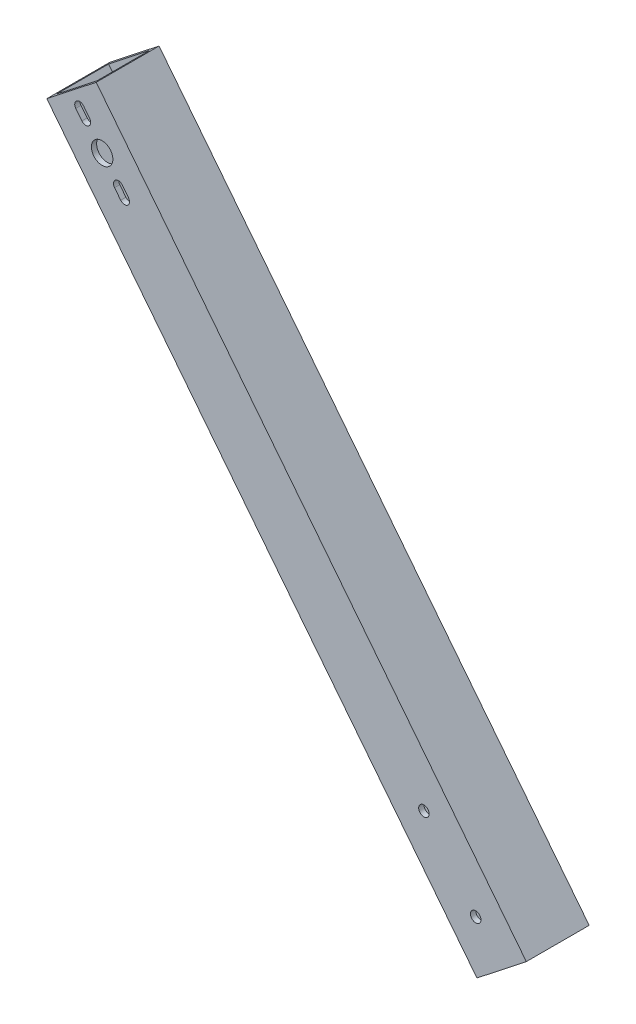
ISO-10303-21;
HEADER;
FILE_DESCRIPTION(('STEP AP214'),'2;1');
FILE_NAME('part.step','',(''),(''),'','','');
FILE_SCHEMA(('AUTOMOTIVE_DESIGN { 1 0 10303 214 1 1 1 1 }'));
ENDSEC;
DATA;
#1=APPLICATION_CONTEXT('core data for automotive mechanical design processes');
#2=APPLICATION_PROTOCOL_DEFINITION('international standard','automotive_design',2000,#1);
#3=PRODUCT_CONTEXT('',#1,'mechanical');
#4=PRODUCT('Part','Part','',(#3));
#5=PRODUCT_RELATED_PRODUCT_CATEGORY('part','',(#4));
#6=PRODUCT_DEFINITION_FORMATION('','',#4);
#7=PRODUCT_DEFINITION_CONTEXT('part definition',#1,'design');
#8=PRODUCT_DEFINITION('design','',#6,#7);
#9=PRODUCT_DEFINITION_SHAPE('','',#8);
#10=(LENGTH_UNIT() NAMED_UNIT(*) SI_UNIT(.MILLI.,.METRE.));
#11=(NAMED_UNIT(*) PLANE_ANGLE_UNIT() SI_UNIT($,.RADIAN.));
#12=(NAMED_UNIT(*) SI_UNIT($,.STERADIAN.) SOLID_ANGLE_UNIT());
#13=UNCERTAINTY_MEASURE_WITH_UNIT(LENGTH_MEASURE(1.E-05),#10,'distance_accuracy_value','');
#14=(GEOMETRIC_REPRESENTATION_CONTEXT(3) GLOBAL_UNCERTAINTY_ASSIGNED_CONTEXT((#13)) GLOBAL_UNIT_ASSIGNED_CONTEXT((#10,
#11,#12)) REPRESENTATION_CONTEXT('',''));
#15=CARTESIAN_POINT('',(0.,0.,0.));
#16=DIRECTION('',(0.,0.,1.));
#17=DIRECTION('',(1.,0.,0.));
#18=AXIS2_PLACEMENT_3D('',#15,#16,#17);
#19=CARTESIAN_POINT('',(-90.1801665532272,35.,19.05));
#20=DIRECTION('',(-0.618490386596824,0.78579236550587,0.));
#21=DIRECTION('',(-0.78579236550587,-0.618490386596824,0.));
#22=AXIS2_PLACEMENT_3D('',#19,#20,#21);
#23=PLANE('',#22);
#24=DIRECTION('',(0.78579236550587,0.618490386596824,0.));
#25=VECTOR('',#24,1.);
#26=CARTESIAN_POINT('',(-90.1801665532272,35.,0.));
#27=LINE('',#26,#25);
#28=CARTESIAN_POINT('',(-90.1801665532272,35.,0.));
#29=VERTEX_POINT('',#28);
#30=CARTESIAN_POINT('',(-75.2108219903403,46.7822418646695,0.));
#31=VERTEX_POINT('',#30);
#32=EDGE_CURVE('E365',#29,#31,#27,.T.);
#33=ORIENTED_EDGE('',*,*,#32,.T.);
#34=DIRECTION('',(0.,0.,-1.));
#35=VECTOR('',#34,1.);
#36=CARTESIAN_POINT('',(-75.2108219903403,46.7822418646695,19.05));
#37=LINE('',#36,#35);
#38=CARTESIAN_POINT('',(-75.2108219903403,46.7822418646695,19.05));
#39=VERTEX_POINT('',#38);
#40=EDGE_CURVE('E375',#39,#31,#37,.T.);
#41=ORIENTED_EDGE('',*,*,#40,.F.);
#42=DIRECTION('',(0.78579236550587,0.618490386596824,0.));
#43=VECTOR('',#42,1.);
#44=CARTESIAN_POINT('',(-90.1801665532272,35.,19.05));
#45=LINE('',#44,#43);
#46=CARTESIAN_POINT('',(-90.1801665532272,35.,19.05));
#47=VERTEX_POINT('',#46);
#48=EDGE_CURVE('E355',#47,#39,#45,.T.);
#49=ORIENTED_EDGE('',*,*,#48,.F.);
#50=DIRECTION('',(0.,0.,-1.));
#51=VECTOR('',#50,1.);
#52=CARTESIAN_POINT('',(-90.1801665532272,35.,19.05));
#53=LINE('',#52,#51);
#54=EDGE_CURVE('E372',#47,#29,#53,.T.);
#55=ORIENTED_EDGE('',*,*,#54,.T.);
#56=EDGE_LOOP('',(#33,#41,#49,#55));
#57=FACE_BOUND('',#56,.T.);
#58=DIRECTION('',(0.78579236550587,0.618490386596824,0.));
#59=VECTOR('',#58,1.);
#60=CARTESIAN_POINT('',(-51.5068272617335,65.4394514624581,1.5875));
#61=LINE('',#60,#59);
#62=CARTESIAN_POINT('',(-88.9327211729866,35.9818534887225,1.5875));
#63=VERTEX_POINT('',#62);
#64=CARTESIAN_POINT('',(-76.4582673705809,45.800388375947,1.5875));
#65=VERTEX_POINT('',#64);
#66=EDGE_CURVE('E329',#63,#65,#61,.T.);
#67=ORIENTED_EDGE('',*,*,#66,.F.);
#68=DIRECTION('',(0.,0.,-1.));
#69=VECTOR('',#68,1.);
#70=CARTESIAN_POINT('',(-88.9327211729866,35.9818534887225,19.05));
#71=LINE('',#70,#69);
#72=CARTESIAN_POINT('',(-88.9327211729866,35.9818534887225,17.4625));
#73=VERTEX_POINT('',#72);
#74=EDGE_CURVE('E339',#73,#63,#71,.T.);
#75=ORIENTED_EDGE('',*,*,#74,.F.);
#76=DIRECTION('',(0.78579236550587,0.618490386596824,0.));
#77=VECTOR('',#76,1.);
#78=CARTESIAN_POINT('',(-51.5068272617335,65.4394514624581,17.4625));
#79=LINE('',#78,#77);
#80=CARTESIAN_POINT('',(-76.4582673705809,45.800388375947,17.4625));
#81=VERTEX_POINT('',#80);
#82=EDGE_CURVE('E334',#73,#81,#79,.T.);
#83=ORIENTED_EDGE('',*,*,#82,.T.);
#84=DIRECTION('',(0.,0.,-1.));
#85=VECTOR('',#84,1.);
#86=CARTESIAN_POINT('',(-76.4582673705809,45.8003883759471,19.05));
#87=LINE('',#86,#85);
#88=EDGE_CURVE('E333',#81,#65,#87,.T.);
#89=ORIENTED_EDGE('',*,*,#88,.T.);
#90=EDGE_LOOP('',(#67,#75,#83,#89));
#91=FACE_BOUND('',#90,.T.);
#92=ADVANCED_FACE('F33',(#57,#91),#23,.F.);
#93=CARTESIAN_POINT('',(-220.57030985557,200.660746495948,19.05));
#94=DIRECTION('',(-0.618490386596824,0.78579236550587,0.));
#95=DIRECTION('',(-0.78579236550587,-0.618490386596824,0.));
#96=AXIS2_PLACEMENT_3D('',#93,#94,#95);
#97=PLANE('',#96);
#98=DIRECTION('',(0.,0.,-1.));
#99=VECTOR('',#98,1.);
#100=CARTESIAN_POINT('',(-206.848410672923,211.461134871895,1.5875));
#101=LINE('',#100,#99);
#102=CARTESIAN_POINT('',(-206.848410672923,211.461134871895,17.4625));
#103=VERTEX_POINT('',#102);
#104=CARTESIAN_POINT('',(-206.848410672923,211.461134871895,1.5875));
#105=VERTEX_POINT('',#104);
#106=EDGE_CURVE('E313',#103,#105,#101,.T.);
#107=ORIENTED_EDGE('',*,*,#106,.F.);
#108=DIRECTION('',(0.785792365505869,0.618490386596826,0.));
#109=VECTOR('',#108,1.);
#110=CARTESIAN_POINT('',(-219.322864475329,201.64259998467,17.4625));
#111=LINE('',#110,#109);
#112=CARTESIAN_POINT('',(-219.322864475329,201.64259998467,17.4625));
#113=VERTEX_POINT('',#112);
#114=EDGE_CURVE('E322',#113,#103,#111,.T.);
#115=ORIENTED_EDGE('',*,*,#114,.F.);
#116=DIRECTION('',(0.,0.,1.));
#117=VECTOR('',#116,1.);
#118=CARTESIAN_POINT('',(-219.322864475329,201.64259998467,1.5875));
#119=LINE('',#118,#117);
#120=CARTESIAN_POINT('',(-219.322864475329,201.64259998467,1.5875));
#121=VERTEX_POINT('',#120);
#122=EDGE_CURVE('E319',#121,#113,#119,.T.);
#123=ORIENTED_EDGE('',*,*,#122,.F.);
#124=DIRECTION('',(-0.78579236550587,-0.618490386596824,0.));
#125=VECTOR('',#124,1.);
#126=CARTESIAN_POINT('',(-219.322864475329,201.64259998467,1.5875));
#127=LINE('',#126,#125);
#128=EDGE_CURVE('E316',#105,#121,#127,.T.);
#129=ORIENTED_EDGE('',*,*,#128,.F.);
#130=EDGE_LOOP('',(#107,#115,#123,#129));
#131=FACE_BOUND('',#130,.T.);
#132=DIRECTION('',(0.78579236550587,0.618490386596824,0.));
#133=VECTOR('',#132,1.);
#134=CARTESIAN_POINT('',(-220.57030985557,200.660746495948,0.));
#135=LINE('',#134,#133);
#136=CARTESIAN_POINT('',(-220.57030985557,200.660746495948,0.));
#137=VERTEX_POINT('',#136);
#138=CARTESIAN_POINT('',(-205.600965292683,212.442988360617,0.));
#139=VERTEX_POINT('',#138);
#140=EDGE_CURVE('E342',#137,#139,#135,.T.);
#141=ORIENTED_EDGE('',*,*,#140,.F.);
#142=DIRECTION('',(0.,0.,-1.));
#143=VECTOR('',#142,1.);
#144=CARTESIAN_POINT('',(-220.57030985557,200.660746495948,19.05));
#145=LINE('',#144,#143);
#146=CARTESIAN_POINT('',(-220.57030985557,200.660746495948,19.05));
#147=VERTEX_POINT('',#146);
#148=EDGE_CURVE('E369',#147,#137,#145,.T.);
#149=ORIENTED_EDGE('',*,*,#148,.F.);
#150=DIRECTION('',(0.78579236550587,0.618490386596824,0.));
#151=VECTOR('',#150,1.);
#152=CARTESIAN_POINT('',(-220.57030985557,200.660746495948,19.05));
#153=LINE('',#152,#151);
#154=CARTESIAN_POINT('',(-205.600965292683,212.442988360617,19.05));
#155=VERTEX_POINT('',#154);
#156=EDGE_CURVE('E348',#147,#155,#153,.T.);
#157=ORIENTED_EDGE('',*,*,#156,.T.);
#158=DIRECTION('',(0.,0.,-1.));
#159=VECTOR('',#158,1.);
#160=CARTESIAN_POINT('',(-205.600965292683,212.442988360617,19.05));
#161=LINE('',#160,#159);
#162=EDGE_CURVE('E359',#155,#139,#161,.T.);
#163=ORIENTED_EDGE('',*,*,#162,.T.);
#164=EDGE_LOOP('',(#141,#149,#157,#163));
#165=FACE_BOUND('',#164,.T.);
#166=ADVANCED_FACE('F35',(#131,#165),#97,.T.);
#167=CARTESIAN_POINT('',(-220.57030985557,200.660746495948,19.05));
#168=DIRECTION('',(0.78579236550587,0.618490386596824,0.));
#169=DIRECTION('',(-0.618490386596824,0.78579236550587,0.));
#170=AXIS2_PLACEMENT_3D('',#167,#168,#169);
#171=PLANE('',#170);
#172=DIRECTION('',(0.618490386596824,-0.78579236550587,0.));
#173=VECTOR('',#172,1.);
#174=CARTESIAN_POINT('',(-220.57030985557,200.660746495948,0.));
#175=LINE('',#174,#173);
#176=EDGE_CURVE('E352',#137,#29,#175,.T.);
#177=ORIENTED_EDGE('',*,*,#176,.T.);
#178=ORIENTED_EDGE('',*,*,#54,.F.);
#179=DIRECTION('',(0.618490386596824,-0.78579236550587,0.));
#180=VECTOR('',#179,1.);
#181=CARTESIAN_POINT('',(-220.57030985557,200.660746495948,19.05));
#182=LINE('',#181,#180);
#183=EDGE_CURVE('E357',#147,#47,#182,.T.);
#184=ORIENTED_EDGE('',*,*,#183,.F.);
#185=ORIENTED_EDGE('',*,*,#148,.T.);
#186=EDGE_LOOP('',(#177,#178,#184,#185));
#187=FACE_BOUND('',#186,.T.);
#188=ADVANCED_FACE('F430',(#187),#171,.F.);
#189=CARTESIAN_POINT('',(-205.600965292683,212.442988360617,19.05));
#190=DIRECTION('',(0.78579236550587,0.618490386596824,0.));
#191=DIRECTION('',(-0.618490386596824,0.78579236550587,0.));
#192=AXIS2_PLACEMENT_3D('',#189,#190,#191);
#193=PLANE('',#192);
#194=DIRECTION('',(0.618490386596824,-0.78579236550587,0.));
#195=VECTOR('',#194,1.);
#196=CARTESIAN_POINT('',(-205.600965292683,212.442988360617,0.));
#197=LINE('',#196,#195);
#198=EDGE_CURVE('E362',#139,#31,#197,.T.);
#199=ORIENTED_EDGE('',*,*,#198,.F.);
#200=ORIENTED_EDGE('',*,*,#162,.F.);
#201=DIRECTION('',(0.618490386596824,-0.78579236550587,0.));
#202=VECTOR('',#201,1.);
#203=CARTESIAN_POINT('',(-205.600965292683,212.442988360617,19.05));
#204=LINE('',#203,#202);
#205=EDGE_CURVE('E351',#155,#39,#204,.T.);
#206=ORIENTED_EDGE('',*,*,#205,.T.);
#207=ORIENTED_EDGE('',*,*,#40,.T.);
#208=EDGE_LOOP('',(#199,#200,#206,#207));
#209=FACE_BOUND('',#208,.T.);
#210=ADVANCED_FACE('F435',(#209),#193,.T.);
#211=CARTESIAN_POINT('',(0.,0.,19.05));
#212=DIRECTION('',(0.,0.,-1.));
#213=DIRECTION('',(-1.,0.,0.));
#214=AXIS2_PLACEMENT_3D('',#211,#212,#213);
#215=PLANE('',#214);
#216=CARTESIAN_POINT('',(-208.755814971609,201.050825506234,19.05));
#217=DIRECTION('',(0.,0.,1.));
#218=DIRECTION('',(1.,0.,0.));
#219=AXIS2_PLACEMENT_3D('',#216,#217,#218);
#220=CIRCLE('',#219,1.50000000000003);
#221=CARTESIAN_POINT('',(-209.934503519868,200.123089926339,19.05));
#222=VERTEX_POINT('',#221);
#223=CARTESIAN_POINT('',(-207.57712642335,201.978561086129,19.05));
#224=VERTEX_POINT('',#223);
#225=EDGE_CURVE('E218',#222,#224,#220,.T.);
#226=ORIENTED_EDGE('',*,*,#225,.F.);
#227=DIRECTION('',(0.618490386596824,-0.785792365505871,0.));
#228=VECTOR('',#227,1.);
#229=CARTESIAN_POINT('',(-211.789974679658,202.480467022856,19.05));
#230=LINE('',#229,#228);
#231=CARTESIAN_POINT('',(-211.789974679658,202.480467022856,19.05));
#232=VERTEX_POINT('',#231);
#233=EDGE_CURVE('E527',#232,#222,#230,.T.);
#234=ORIENTED_EDGE('',*,*,#233,.F.);
#235=CARTESIAN_POINT('',(-210.611286131399,203.408202602752,19.05));
#236=DIRECTION('',(0.,0.,1.));
#237=DIRECTION('',(1.,0.,0.));
#238=AXIS2_PLACEMENT_3D('',#235,#236,#237);
#239=CIRCLE('',#238,1.50000000000003);
#240=CARTESIAN_POINT('',(-209.43259758314,204.335938182647,19.05));
#241=VERTEX_POINT('',#240);
#242=EDGE_CURVE('E222',#241,#232,#239,.T.);
#243=ORIENTED_EDGE('',*,*,#242,.F.);
#244=DIRECTION('',(-0.618490386596824,0.785792365505871,0.));
#245=VECTOR('',#244,1.);
#246=CARTESIAN_POINT('',(-209.43259758314,204.335938182647,19.05));
#247=LINE('',#246,#245);
#248=EDGE_CURVE('E48',#224,#241,#247,.T.);
#249=ORIENTED_EDGE('',*,*,#248,.F.);
#250=EDGE_LOOP('',(#226,#234,#243,#249));
#251=FACE_BOUND('',#250,.T.);
#252=CARTESIAN_POINT('',(-197.004497626269,186.120770561622,19.05));
#253=DIRECTION('',(0.,0.,1.));
#254=DIRECTION('',(1.,0.,0.));
#255=AXIS2_PLACEMENT_3D('',#252,#253,#254);
#256=CIRCLE('',#255,1.49999999999999);
#257=CARTESIAN_POINT('',(-198.183186174528,185.193034981727,19.05));
#258=VERTEX_POINT('',#257);
#259=CARTESIAN_POINT('',(-195.82580907801,187.048506141518,19.05));
#260=VERTEX_POINT('',#259);
#261=EDGE_CURVE('E246',#258,#260,#256,.T.);
#262=ORIENTED_EDGE('',*,*,#261,.F.);
#263=DIRECTION('',(0.61849038659682,-0.785792365505873,0.));
#264=VECTOR('',#263,1.);
#265=CARTESIAN_POINT('',(-200.038657334318,187.550412078245,19.05));
#266=LINE('',#265,#264);
#267=CARTESIAN_POINT('',(-200.038657334318,187.550412078245,19.05));
#268=VERTEX_POINT('',#267);
#269=EDGE_CURVE('E249',#268,#258,#266,.T.);
#270=ORIENTED_EDGE('',*,*,#269,.F.);
#271=CARTESIAN_POINT('',(-198.85996878606,188.47814765814,19.05));
#272=DIRECTION('',(0.,0.,1.));
#273=DIRECTION('',(1.,0.,0.));
#274=AXIS2_PLACEMENT_3D('',#271,#272,#273);
#275=CIRCLE('',#274,1.49999999999999);
#276=CARTESIAN_POINT('',(-197.681280237801,189.405883238035,19.05));
#277=VERTEX_POINT('',#276);
#278=EDGE_CURVE('E242',#277,#268,#275,.T.);
#279=ORIENTED_EDGE('',*,*,#278,.F.);
#280=DIRECTION('',(-0.61849038659682,0.785792365505873,0.));
#281=VECTOR('',#280,1.);
#282=CARTESIAN_POINT('',(-197.681280237801,189.405883238035,19.05));
#283=LINE('',#282,#281);
#284=EDGE_CURVE('E243',#260,#277,#283,.T.);
#285=ORIENTED_EDGE('',*,*,#284,.F.);
#286=EDGE_LOOP('',(#262,#270,#279,#285));
#287=FACE_BOUND('',#286,.T.);
#288=CARTESIAN_POINT('',(-90.5503221815634,50.8706839742593,19.05));
#289=DIRECTION('',(0.,0.,1.));
#290=DIRECTION('',(1.,0.,0.));
#291=AXIS2_PLACEMENT_3D('',#288,#289,#290);
#292=CIRCLE('',#291,1.5875);
#293=CARTESIAN_POINT('',(-88.9628221815634,50.8706839742593,19.05));
#294=VERTEX_POINT('',#293);
#295=EDGE_CURVE('E289',#294,#294,#292,.T.);
#296=ORIENTED_EDGE('',*,*,#295,.F.);
#297=EDGE_LOOP('',(#296));
#298=FACE_BOUND('',#297,.T.);
#299=CARTESIAN_POINT('',(-106.259978001123,70.8298100581084,19.05));
#300=DIRECTION('',(0.,0.,1.));
#301=DIRECTION('',(1.,0.,0.));
#302=AXIS2_PLACEMENT_3D('',#299,#300,#301);
#303=CIRCLE('',#302,1.5875);
#304=CARTESIAN_POINT('',(-104.672478001123,70.8298100581084,19.05));
#305=VERTEX_POINT('',#304);
#306=EDGE_CURVE('E299',#305,#305,#303,.T.);
#307=ORIENTED_EDGE('',*,*,#306,.F.);
#308=EDGE_LOOP('',(#307));
#309=FACE_BOUND('',#308,.T.);
#310=CARTESIAN_POINT('',(-203.807891878834,194.764486582187,19.05));
#311=DIRECTION('',(0.,0.,1.));
#312=DIRECTION('',(1.,0.,0.));
#313=AXIS2_PLACEMENT_3D('',#310,#311,#312);
#314=CIRCLE('',#313,3.25000000000001);
#315=CARTESIAN_POINT('',(-200.557891878834,194.764486582187,19.05));
#316=VERTEX_POINT('',#315);
#317=EDGE_CURVE('E309',#316,#316,#314,.T.);
#318=ORIENTED_EDGE('',*,*,#317,.F.);
#319=EDGE_LOOP('',(#318));
#320=FACE_BOUND('',#319,.T.);
#321=ORIENTED_EDGE('',*,*,#156,.F.);
#322=ORIENTED_EDGE('',*,*,#183,.T.);
#323=ORIENTED_EDGE('',*,*,#48,.T.);
#324=ORIENTED_EDGE('',*,*,#205,.F.);
#325=EDGE_LOOP('',(#321,#322,#323,#324));
#326=FACE_BOUND('',#325,.T.);
#327=ADVANCED_FACE('F437',(#251,#287,#298,#309,#320,#326),#215,.F.);
#328=CARTESIAN_POINT('',(0.,0.,0.));
#329=DIRECTION('',(0.,0.,-1.));
#330=DIRECTION('',(-1.,0.,0.));
#331=AXIS2_PLACEMENT_3D('',#328,#329,#330);
#332=PLANE('',#331);
#333=DIRECTION('',(0.618490386596824,-0.785792365505871,0.));
#334=VECTOR('',#333,1.);
#335=CARTESIAN_POINT('',(-211.789974679658,202.480467022856,0.));
#336=LINE('',#335,#334);
#337=CARTESIAN_POINT('',(-211.789974679658,202.480467022856,0.));
#338=VERTEX_POINT('',#337);
#339=CARTESIAN_POINT('',(-209.934503519868,200.123089926339,0.));
#340=VERTEX_POINT('',#339);
#341=EDGE_CURVE('E210',#338,#340,#336,.T.);
#342=ORIENTED_EDGE('',*,*,#341,.T.);
#343=CARTESIAN_POINT('',(-208.755814971609,201.050825506234,0.));
#344=DIRECTION('',(0.,0.,-1.));
#345=DIRECTION('',(-1.,0.,0.));
#346=AXIS2_PLACEMENT_3D('',#343,#344,#345);
#347=CIRCLE('',#346,1.50000000000003);
#348=CARTESIAN_POINT('',(-207.57712642335,201.978561086129,0.));
#349=VERTEX_POINT('',#348);
#350=EDGE_CURVE('E196',#340,#349,#347,.F.);
#351=ORIENTED_EDGE('',*,*,#350,.T.);
#352=DIRECTION('',(-0.618490386596824,0.785792365505871,0.));
#353=VECTOR('',#352,1.);
#354=CARTESIAN_POINT('',(-209.43259758314,204.335938182647,0.));
#355=LINE('',#354,#353);
#356=CARTESIAN_POINT('',(-209.43259758314,204.335938182647,0.));
#357=VERTEX_POINT('',#356);
#358=EDGE_CURVE('E227',#349,#357,#355,.T.);
#359=ORIENTED_EDGE('',*,*,#358,.T.);
#360=CARTESIAN_POINT('',(-210.611286131399,203.408202602752,0.));
#361=DIRECTION('',(0.,0.,-1.));
#362=DIRECTION('',(-1.,0.,0.));
#363=AXIS2_PLACEMENT_3D('',#360,#361,#362);
#364=CIRCLE('',#363,1.50000000000003);
#365=EDGE_CURVE('E216',#357,#338,#364,.F.);
#366=ORIENTED_EDGE('',*,*,#365,.T.);
#367=EDGE_LOOP('',(#342,#351,#359,#366));
#368=FACE_BOUND('',#367,.T.);
#369=DIRECTION('',(0.61849038659682,-0.785792365505873,0.));
#370=VECTOR('',#369,1.);
#371=CARTESIAN_POINT('',(-200.038657334318,187.550412078245,0.));
#372=LINE('',#371,#370);
#373=CARTESIAN_POINT('',(-200.038657334318,187.550412078245,0.));
#374=VERTEX_POINT('',#373);
#375=CARTESIAN_POINT('',(-198.183186174528,185.193034981727,0.));
#376=VERTEX_POINT('',#375);
#377=EDGE_CURVE('E245',#374,#376,#372,.T.);
#378=ORIENTED_EDGE('',*,*,#377,.T.);
#379=CARTESIAN_POINT('',(-197.004497626269,186.120770561622,0.));
#380=DIRECTION('',(0.,0.,-1.));
#381=DIRECTION('',(-1.,0.,0.));
#382=AXIS2_PLACEMENT_3D('',#379,#380,#381);
#383=CIRCLE('',#382,1.49999999999999);
#384=CARTESIAN_POINT('',(-195.82580907801,187.048506141518,0.));
#385=VERTEX_POINT('',#384);
#386=EDGE_CURVE('E267',#376,#385,#383,.F.);
#387=ORIENTED_EDGE('',*,*,#386,.T.);
#388=DIRECTION('',(-0.61849038659682,0.785792365505873,0.));
#389=VECTOR('',#388,1.);
#390=CARTESIAN_POINT('',(-197.681280237801,189.405883238035,0.));
#391=LINE('',#390,#389);
#392=CARTESIAN_POINT('',(-197.681280237801,189.405883238035,0.));
#393=VERTEX_POINT('',#392);
#394=EDGE_CURVE('E262',#385,#393,#391,.T.);
#395=ORIENTED_EDGE('',*,*,#394,.T.);
#396=CARTESIAN_POINT('',(-198.85996878606,188.47814765814,0.));
#397=DIRECTION('',(0.,0.,-1.));
#398=DIRECTION('',(-1.,0.,0.));
#399=AXIS2_PLACEMENT_3D('',#396,#397,#398);
#400=CIRCLE('',#399,1.49999999999999);
#401=EDGE_CURVE('E257',#393,#374,#400,.F.);
#402=ORIENTED_EDGE('',*,*,#401,.T.);
#403=EDGE_LOOP('',(#378,#387,#395,#402));
#404=FACE_BOUND('',#403,.T.);
#405=CARTESIAN_POINT('',(-90.5503221815634,50.8706839742593,0.));
#406=DIRECTION('',(0.,0.,1.));
#407=DIRECTION('',(1.,0.,0.));
#408=AXIS2_PLACEMENT_3D('',#405,#406,#407);
#409=CIRCLE('',#408,1.5875);
#410=CARTESIAN_POINT('',(-88.9628221815634,50.8706839742593,0.));
#411=VERTEX_POINT('',#410);
#412=EDGE_CURVE('E290',#411,#411,#409,.T.);
#413=ORIENTED_EDGE('',*,*,#412,.T.);
#414=EDGE_LOOP('',(#413));
#415=FACE_BOUND('',#414,.T.);
#416=CARTESIAN_POINT('',(-106.259978001123,70.8298100581084,0.));
#417=DIRECTION('',(0.,0.,1.));
#418=DIRECTION('',(1.,0.,0.));
#419=AXIS2_PLACEMENT_3D('',#416,#417,#418);
#420=CIRCLE('',#419,1.5875);
#421=CARTESIAN_POINT('',(-104.672478001123,70.8298100581084,0.));
#422=VERTEX_POINT('',#421);
#423=EDGE_CURVE('E300',#422,#422,#420,.T.);
#424=ORIENTED_EDGE('',*,*,#423,.T.);
#425=EDGE_LOOP('',(#424));
#426=FACE_BOUND('',#425,.T.);
#427=ORIENTED_EDGE('',*,*,#140,.T.);
#428=ORIENTED_EDGE('',*,*,#198,.T.);
#429=ORIENTED_EDGE('',*,*,#32,.F.);
#430=ORIENTED_EDGE('',*,*,#176,.F.);
#431=EDGE_LOOP('',(#427,#428,#429,#430));
#432=FACE_BOUND('',#431,.T.);
#433=ADVANCED_FACE('F214',(#368,#404,#415,#426,#432),#332,.T.);
#434=CARTESIAN_POINT('',(-219.322864475329,201.64259998467,19.05));
#435=DIRECTION('',(0.78579236550587,0.618490386596824,0.));
#436=DIRECTION('',(-0.618490386596824,0.78579236550587,0.));
#437=AXIS2_PLACEMENT_3D('',#434,#435,#436);
#438=PLANE('',#437);
#439=DIRECTION('',(0.618490386596824,-0.78579236550587,0.));
#440=VECTOR('',#439,1.);
#441=CARTESIAN_POINT('',(-37.4258939112531,-29.4575979737356,1.5875));
#442=LINE('',#441,#440);
#443=EDGE_CURVE('E326',#121,#63,#442,.T.);
#444=ORIENTED_EDGE('',*,*,#443,.F.);
#445=ORIENTED_EDGE('',*,*,#122,.T.);
#446=DIRECTION('',(0.618490386596824,-0.78579236550587,0.));
#447=VECTOR('',#446,1.);
#448=CARTESIAN_POINT('',(-37.4258939112531,-29.4575979737356,17.4625));
#449=LINE('',#448,#447);
#450=EDGE_CURVE('E330',#113,#73,#449,.T.);
#451=ORIENTED_EDGE('',*,*,#450,.T.);
#452=ORIENTED_EDGE('',*,*,#74,.T.);
#453=EDGE_LOOP('',(#444,#445,#451,#452));
#454=FACE_BOUND('',#453,.T.);
#455=ADVANCED_FACE('F460',(#454),#438,.T.);
#456=CARTESIAN_POINT('',(-206.848410672923,211.461134871895,19.05));
#457=DIRECTION('',(0.78579236550587,0.618490386596824,0.));
#458=DIRECTION('',(-0.618490386596824,0.78579236550587,0.));
#459=AXIS2_PLACEMENT_3D('',#456,#457,#458);
#460=PLANE('',#459);
#461=DIRECTION('',(0.618490386596824,-0.78579236550587,0.));
#462=VECTOR('',#461,1.);
#463=CARTESIAN_POINT('',(-24.9514401088474,-19.639063086511,1.5875));
#464=LINE('',#463,#462);
#465=EDGE_CURVE('E325',#105,#65,#464,.T.);
#466=ORIENTED_EDGE('',*,*,#465,.T.);
#467=ORIENTED_EDGE('',*,*,#88,.F.);
#468=DIRECTION('',(0.618490386596824,-0.78579236550587,0.));
#469=VECTOR('',#468,1.);
#470=CARTESIAN_POINT('',(-24.9514401088474,-19.639063086511,17.4625));
#471=LINE('',#470,#469);
#472=EDGE_CURVE('E328',#103,#81,#471,.T.);
#473=ORIENTED_EDGE('',*,*,#472,.F.);
#474=ORIENTED_EDGE('',*,*,#106,.T.);
#475=EDGE_LOOP('',(#466,#467,#473,#474));
#476=FACE_BOUND('',#475,.T.);
#477=ADVANCED_FACE('F464',(#476),#460,.F.);
#478=CARTESIAN_POINT('',(0.,0.,17.4625));
#479=DIRECTION('',(0.,0.,-1.));
#480=DIRECTION('',(-1.,0.,0.));
#481=AXIS2_PLACEMENT_3D('',#478,#479,#480);
#482=PLANE('',#481);
#483=DIRECTION('',(-0.618490386596824,0.785792365505871,0.));
#484=VECTOR('',#483,1.);
#485=CARTESIAN_POINT('',(-32.3673555583092,-25.4760661100187,17.4625));
#486=LINE('',#485,#484);
#487=CARTESIAN_POINT('',(-209.934503519868,200.123089926339,17.4625));
#488=VERTEX_POINT('',#487);
#489=CARTESIAN_POINT('',(-211.789974679658,202.480467022856,17.4625));
#490=VERTEX_POINT('',#489);
#491=EDGE_CURVE('E239',#488,#490,#486,.T.);
#492=ORIENTED_EDGE('',*,*,#491,.F.);
#493=CARTESIAN_POINT('',(-208.755814971609,201.050825506234,17.4625));
#494=DIRECTION('',(0.,0.,-1.));
#495=DIRECTION('',(-1.,0.,0.));
#496=AXIS2_PLACEMENT_3D('',#493,#494,#495);
#497=CIRCLE('',#496,1.50000000000003);
#498=CARTESIAN_POINT('',(-207.57712642335,201.978561086129,17.4625));
#499=VERTEX_POINT('',#498);
#500=EDGE_CURVE('E237',#499,#488,#497,.T.);
#501=ORIENTED_EDGE('',*,*,#500,.F.);
#502=DIRECTION('',(0.618490386596824,-0.785792365505871,0.));
#503=VECTOR('',#502,1.);
#504=CARTESIAN_POINT('',(-30.0099784617916,-23.6205949502282,17.4625));
#505=LINE('',#504,#503);
#506=CARTESIAN_POINT('',(-209.43259758314,204.335938182647,17.4625));
#507=VERTEX_POINT('',#506);
#508=EDGE_CURVE('E235',#507,#499,#505,.T.);
#509=ORIENTED_EDGE('',*,*,#508,.F.);
#510=CARTESIAN_POINT('',(-210.611286131399,203.408202602752,17.4625));
#511=DIRECTION('',(0.,0.,-1.));
#512=DIRECTION('',(-1.,0.,0.));
#513=AXIS2_PLACEMENT_3D('',#510,#511,#512);
#514=CIRCLE('',#513,1.50000000000003);
#515=EDGE_CURVE('E233',#490,#507,#514,.T.);
#516=ORIENTED_EDGE('',*,*,#515,.F.);
#517=EDGE_LOOP('',(#492,#501,#509,#516));
#518=FACE_BOUND('',#517,.T.);
#519=DIRECTION('',(-0.61849038659682,0.785792365505873,0.));
#520=VECTOR('',#519,1.);
#521=CARTESIAN_POINT('',(-32.3673555583102,-25.4760661100192,17.4625));
#522=LINE('',#521,#520);
#523=CARTESIAN_POINT('',(-198.183186174528,185.193034981727,17.4625));
#524=VERTEX_POINT('',#523);
#525=CARTESIAN_POINT('',(-200.038657334318,187.550412078245,17.4625));
#526=VERTEX_POINT('',#525);
#527=EDGE_CURVE('E286',#524,#526,#522,.T.);
#528=ORIENTED_EDGE('',*,*,#527,.F.);
#529=CARTESIAN_POINT('',(-197.004497626269,186.120770561622,17.4625));
#530=DIRECTION('',(0.,0.,-1.));
#531=DIRECTION('',(-1.,0.,0.));
#532=AXIS2_PLACEMENT_3D('',#529,#530,#531);
#533=CIRCLE('',#532,1.49999999999999);
#534=CARTESIAN_POINT('',(-195.82580907801,187.048506141518,17.4625));
#535=VERTEX_POINT('',#534);
#536=EDGE_CURVE('E284',#535,#524,#533,.T.);
#537=ORIENTED_EDGE('',*,*,#536,.F.);
#538=DIRECTION('',(0.61849038659682,-0.785792365505873,0.));
#539=VECTOR('',#538,1.);
#540=CARTESIAN_POINT('',(-30.0099784617926,-23.6205949502287,17.4625));
#541=LINE('',#540,#539);
#542=CARTESIAN_POINT('',(-197.681280237801,189.405883238035,17.4625));
#543=VERTEX_POINT('',#542);
#544=EDGE_CURVE('E282',#543,#535,#541,.T.);
#545=ORIENTED_EDGE('',*,*,#544,.F.);
#546=CARTESIAN_POINT('',(-198.85996878606,188.47814765814,17.4625));
#547=DIRECTION('',(0.,0.,-1.));
#548=DIRECTION('',(-1.,0.,0.));
#549=AXIS2_PLACEMENT_3D('',#546,#547,#548);
#550=CIRCLE('',#549,1.49999999999999);
#551=EDGE_CURVE('E280',#526,#543,#550,.T.);
#552=ORIENTED_EDGE('',*,*,#551,.F.);
#553=EDGE_LOOP('',(#528,#537,#545,#552));
#554=FACE_BOUND('',#553,.T.);
#555=CARTESIAN_POINT('',(-90.5503221815634,50.8706839742593,17.4625));
#556=DIRECTION('',(0.,0.,-1.));
#557=DIRECTION('',(-1.,0.,0.));
#558=AXIS2_PLACEMENT_3D('',#555,#556,#557);
#559=CIRCLE('',#558,1.5875);
#560=CARTESIAN_POINT('',(-92.1378221815634,50.8706839742593,17.4625));
#561=VERTEX_POINT('',#560);
#562=EDGE_CURVE('E296',#561,#561,#559,.T.);
#563=ORIENTED_EDGE('',*,*,#562,.F.);
#564=EDGE_LOOP('',(#563));
#565=FACE_BOUND('',#564,.T.);
#566=CARTESIAN_POINT('',(-106.259978001123,70.8298100581084,17.4625));
#567=DIRECTION('',(0.,0.,-1.));
#568=DIRECTION('',(-1.,0.,0.));
#569=AXIS2_PLACEMENT_3D('',#566,#567,#568);
#570=CIRCLE('',#569,1.5875);
#571=CARTESIAN_POINT('',(-107.847478001123,70.8298100581084,17.4625));
#572=VERTEX_POINT('',#571);
#573=EDGE_CURVE('E306',#572,#572,#570,.T.);
#574=ORIENTED_EDGE('',*,*,#573,.F.);
#575=EDGE_LOOP('',(#574));
#576=FACE_BOUND('',#575,.T.);
#577=CARTESIAN_POINT('',(-203.807891878834,194.764486582187,17.4625));
#578=DIRECTION('',(0.,0.,-1.));
#579=DIRECTION('',(-1.,0.,0.));
#580=AXIS2_PLACEMENT_3D('',#577,#578,#579);
#581=CIRCLE('',#580,3.25000000000001);
#582=CARTESIAN_POINT('',(-207.057891878834,194.764486582187,17.4625));
#583=VERTEX_POINT('',#582);
#584=EDGE_CURVE('E312',#583,#583,#581,.T.);
#585=ORIENTED_EDGE('',*,*,#584,.F.);
#586=EDGE_LOOP('',(#585));
#587=FACE_BOUND('',#586,.T.);
#588=ORIENTED_EDGE('',*,*,#450,.F.);
#589=ORIENTED_EDGE('',*,*,#114,.T.);
#590=ORIENTED_EDGE('',*,*,#472,.T.);
#591=ORIENTED_EDGE('',*,*,#82,.F.);
#592=EDGE_LOOP('',(#588,#589,#590,#591));
#593=FACE_BOUND('',#592,.T.);
#594=ADVANCED_FACE('F471',(#518,#554,#565,#576,#587,#593),#482,.T.);
#595=CARTESIAN_POINT('',(0.,0.,1.5875));
#596=DIRECTION('',(0.,0.,-1.));
#597=DIRECTION('',(-1.,0.,0.));
#598=AXIS2_PLACEMENT_3D('',#595,#596,#597);
#599=PLANE('',#598);
#600=CARTESIAN_POINT('',(-208.755814971609,201.050825506234,1.5875));
#601=DIRECTION('',(0.,0.,-1.));
#602=DIRECTION('',(-1.,0.,0.));
#603=AXIS2_PLACEMENT_3D('',#600,#601,#602);
#604=CIRCLE('',#603,1.50000000000003);
#605=CARTESIAN_POINT('',(-207.57712642335,201.978561086129,1.5875));
#606=VERTEX_POINT('',#605);
#607=CARTESIAN_POINT('',(-209.934503519868,200.123089926339,1.5875));
#608=VERTEX_POINT('',#607);
#609=EDGE_CURVE('E41',#606,#608,#604,.T.);
#610=ORIENTED_EDGE('',*,*,#609,.T.);
#611=DIRECTION('',(-0.618490386596824,0.785792365505871,0.));
#612=VECTOR('',#611,1.);
#613=CARTESIAN_POINT('',(-32.3673555583092,-25.4760661100187,1.5875));
#614=LINE('',#613,#612);
#615=CARTESIAN_POINT('',(-211.789974679658,202.480467022856,1.5875));
#616=VERTEX_POINT('',#615);
#617=EDGE_CURVE('E11',#608,#616,#614,.T.);
#618=ORIENTED_EDGE('',*,*,#617,.T.);
#619=CARTESIAN_POINT('',(-210.611286131399,203.408202602752,1.5875));
#620=DIRECTION('',(0.,0.,-1.));
#621=DIRECTION('',(-1.,0.,0.));
#622=AXIS2_PLACEMENT_3D('',#619,#620,#621);
#623=CIRCLE('',#622,1.50000000000003);
#624=CARTESIAN_POINT('',(-209.43259758314,204.335938182647,1.5875));
#625=VERTEX_POINT('',#624);
#626=EDGE_CURVE('E395',#616,#625,#623,.T.);
#627=ORIENTED_EDGE('',*,*,#626,.T.);
#628=DIRECTION('',(0.618490386596824,-0.785792365505871,0.));
#629=VECTOR('',#628,1.);
#630=CARTESIAN_POINT('',(-30.0099784617916,-23.6205949502282,1.5875));
#631=LINE('',#630,#629);
#632=EDGE_CURVE('E398',#625,#606,#631,.T.);
#633=ORIENTED_EDGE('',*,*,#632,.T.);
#634=EDGE_LOOP('',(#610,#618,#627,#633));
#635=FACE_BOUND('',#634,.T.);
#636=CARTESIAN_POINT('',(-197.004497626269,186.120770561622,1.5875));
#637=DIRECTION('',(0.,0.,-1.));
#638=DIRECTION('',(-1.,0.,0.));
#639=AXIS2_PLACEMENT_3D('',#636,#637,#638);
#640=CIRCLE('',#639,1.49999999999999);
#641=CARTESIAN_POINT('',(-195.82580907801,187.048506141518,1.5875));
#642=VERTEX_POINT('',#641);
#643=CARTESIAN_POINT('',(-198.183186174528,185.193034981727,1.5875));
#644=VERTEX_POINT('',#643);
#645=EDGE_CURVE('E389',#642,#644,#640,.T.);
#646=ORIENTED_EDGE('',*,*,#645,.T.);
#647=DIRECTION('',(-0.61849038659682,0.785792365505873,0.));
#648=VECTOR('',#647,1.);
#649=CARTESIAN_POINT('',(-32.3673555583102,-25.4760661100192,1.5875));
#650=LINE('',#649,#648);
#651=CARTESIAN_POINT('',(-200.038657334318,187.550412078245,1.5875));
#652=VERTEX_POINT('',#651);
#653=EDGE_CURVE('E392',#644,#652,#650,.T.);
#654=ORIENTED_EDGE('',*,*,#653,.T.);
#655=CARTESIAN_POINT('',(-198.85996878606,188.47814765814,1.5875));
#656=DIRECTION('',(0.,0.,-1.));
#657=DIRECTION('',(-1.,0.,0.));
#658=AXIS2_PLACEMENT_3D('',#655,#656,#657);
#659=CIRCLE('',#658,1.49999999999999);
#660=CARTESIAN_POINT('',(-197.681280237801,189.405883238035,1.5875));
#661=VERTEX_POINT('',#660);
#662=EDGE_CURVE('E371',#652,#661,#659,.T.);
#663=ORIENTED_EDGE('',*,*,#662,.T.);
#664=DIRECTION('',(0.61849038659682,-0.785792365505873,0.));
#665=VECTOR('',#664,1.);
#666=CARTESIAN_POINT('',(-30.0099784617926,-23.6205949502287,1.5875));
#667=LINE('',#666,#665);
#668=EDGE_CURVE('E386',#661,#642,#667,.T.);
#669=ORIENTED_EDGE('',*,*,#668,.T.);
#670=EDGE_LOOP('',(#646,#654,#663,#669));
#671=FACE_BOUND('',#670,.T.);
#672=CARTESIAN_POINT('',(-90.5503221815634,50.8706839742593,1.5875));
#673=DIRECTION('',(0.,0.,-1.));
#674=DIRECTION('',(-1.,0.,0.));
#675=AXIS2_PLACEMENT_3D('',#672,#673,#674);
#676=CIRCLE('',#675,1.5875);
#677=CARTESIAN_POINT('',(-92.1378221815634,50.8706839742593,1.5875));
#678=VERTEX_POINT('',#677);
#679=EDGE_CURVE('E293',#678,#678,#676,.T.);
#680=ORIENTED_EDGE('',*,*,#679,.T.);
#681=EDGE_LOOP('',(#680));
#682=FACE_BOUND('',#681,.T.);
#683=CARTESIAN_POINT('',(-106.259978001123,70.8298100581084,1.5875));
#684=DIRECTION('',(0.,0.,-1.));
#685=DIRECTION('',(-1.,0.,0.));
#686=AXIS2_PLACEMENT_3D('',#683,#684,#685);
#687=CIRCLE('',#686,1.5875);
#688=CARTESIAN_POINT('',(-107.847478001123,70.8298100581084,1.5875));
#689=VERTEX_POINT('',#688);
#690=EDGE_CURVE('E303',#689,#689,#687,.T.);
#691=ORIENTED_EDGE('',*,*,#690,.T.);
#692=EDGE_LOOP('',(#691));
#693=FACE_BOUND('',#692,.T.);
#694=ORIENTED_EDGE('',*,*,#465,.F.);
#695=ORIENTED_EDGE('',*,*,#128,.T.);
#696=ORIENTED_EDGE('',*,*,#443,.T.);
#697=ORIENTED_EDGE('',*,*,#66,.T.);
#698=EDGE_LOOP('',(#694,#695,#696,#697));
#699=FACE_BOUND('',#698,.T.);
#700=ADVANCED_FACE('F401',(#635,#671,#682,#693,#699),#599,.F.);
#701=CARTESIAN_POINT('',(-203.807891878834,194.764486582187,16.51));
#702=DIRECTION('',(0.,0.,1.));
#703=DIRECTION('',(1.,0.,0.));
#704=AXIS2_PLACEMENT_3D('',#701,#702,#703);
#705=CYLINDRICAL_SURFACE('',#704,3.25000000000001);
#706=ORIENTED_EDGE('',*,*,#584,.T.);
#707=EDGE_LOOP('',(#706));
#708=FACE_BOUND('',#707,.T.);
#709=ORIENTED_EDGE('',*,*,#317,.T.);
#710=EDGE_LOOP('',(#709));
#711=FACE_BOUND('',#710,.T.);
#712=ADVANCED_FACE('F470',(#708,#711),#705,.F.);
#713=CARTESIAN_POINT('',(-106.259978001123,70.8298100581084,0.));
#714=DIRECTION('',(0.,0.,1.));
#715=DIRECTION('',(1.,0.,0.));
#716=AXIS2_PLACEMENT_3D('',#713,#714,#715);
#717=CYLINDRICAL_SURFACE('',#716,1.5875);
#718=ORIENTED_EDGE('',*,*,#423,.F.);
#719=EDGE_LOOP('',(#718));
#720=FACE_BOUND('',#719,.T.);
#721=ORIENTED_EDGE('',*,*,#690,.F.);
#722=EDGE_LOOP('',(#721));
#723=FACE_BOUND('',#722,.T.);
#724=ADVANCED_FACE('F480',(#720,#723),#717,.F.);
#725=ORIENTED_EDGE('',*,*,#573,.T.);
#726=EDGE_LOOP('',(#725));
#727=FACE_BOUND('',#726,.T.);
#728=ORIENTED_EDGE('',*,*,#306,.T.);
#729=EDGE_LOOP('',(#728));
#730=FACE_BOUND('',#729,.T.);
#731=ADVANCED_FACE('F482',(#727,#730),#717,.F.);
#732=CARTESIAN_POINT('',(-90.5503221815634,50.8706839742593,0.));
#733=DIRECTION('',(0.,0.,1.));
#734=DIRECTION('',(1.,0.,0.));
#735=AXIS2_PLACEMENT_3D('',#732,#733,#734);
#736=CYLINDRICAL_SURFACE('',#735,1.5875);
#737=ORIENTED_EDGE('',*,*,#412,.F.);
#738=EDGE_LOOP('',(#737));
#739=FACE_BOUND('',#738,.T.);
#740=ORIENTED_EDGE('',*,*,#679,.F.);
#741=EDGE_LOOP('',(#740));
#742=FACE_BOUND('',#741,.T.);
#743=ADVANCED_FACE('F485',(#739,#742),#736,.F.);
#744=ORIENTED_EDGE('',*,*,#562,.T.);
#745=EDGE_LOOP('',(#744));
#746=FACE_BOUND('',#745,.T.);
#747=ORIENTED_EDGE('',*,*,#295,.T.);
#748=EDGE_LOOP('',(#747));
#749=FACE_BOUND('',#748,.T.);
#750=ADVANCED_FACE('F487',(#746,#749),#736,.F.);
#751=CARTESIAN_POINT('',(-198.85996878606,188.47814765814,-7.23028972710289));
#752=DIRECTION('',(0.,0.,1.));
#753=DIRECTION('',(1.,0.,0.));
#754=AXIS2_PLACEMENT_3D('',#751,#752,#753);
#755=CYLINDRICAL_SURFACE('',#754,1.49999999999999);
#756=DIRECTION('',(0.,0.,1.));
#757=VECTOR('',#756,1.);
#758=CARTESIAN_POINT('',(-200.038657334318,187.550412078245,-7.23028972710289));
#759=LINE('',#758,#757);
#760=EDGE_CURVE('E277',#374,#652,#759,.T.);
#761=ORIENTED_EDGE('',*,*,#760,.F.);
#762=ORIENTED_EDGE('',*,*,#401,.F.);
#763=DIRECTION('',(0.,0.,1.));
#764=VECTOR('',#763,1.);
#765=CARTESIAN_POINT('',(-197.681280237801,189.405883238035,-7.23028972710289));
#766=LINE('',#765,#764);
#767=EDGE_CURVE('E261',#393,#661,#766,.T.);
#768=ORIENTED_EDGE('',*,*,#767,.T.);
#769=ORIENTED_EDGE('',*,*,#662,.F.);
#770=EDGE_LOOP('',(#761,#762,#768,#769));
#771=FACE_BOUND('',#770,.T.);
#772=ADVANCED_FACE('F421',(#771),#755,.F.);
#773=CARTESIAN_POINT('',(-197.681280237801,189.405883238035,-7.23028972710289));
#774=DIRECTION('',(0.785792365505873,0.61849038659682,0.));
#775=DIRECTION('',(-0.61849038659682,0.785792365505873,0.));
#776=AXIS2_PLACEMENT_3D('',#773,#774,#775);
#777=PLANE('',#776);
#778=ORIENTED_EDGE('',*,*,#767,.F.);
#779=ORIENTED_EDGE('',*,*,#394,.F.);
#780=DIRECTION('',(0.,0.,1.));
#781=VECTOR('',#780,1.);
#782=CARTESIAN_POINT('',(-195.82580907801,187.048506141518,-7.23028972710289));
#783=LINE('',#782,#781);
#784=EDGE_CURVE('E266',#385,#642,#783,.T.);
#785=ORIENTED_EDGE('',*,*,#784,.T.);
#786=ORIENTED_EDGE('',*,*,#668,.F.);
#787=EDGE_LOOP('',(#778,#779,#785,#786));
#788=FACE_BOUND('',#787,.T.);
#789=ADVANCED_FACE('F503',(#788),#777,.F.);
#790=CARTESIAN_POINT('',(-197.004497626269,186.120770561622,-7.23028972710289));
#791=DIRECTION('',(0.,0.,1.));
#792=DIRECTION('',(1.,0.,0.));
#793=AXIS2_PLACEMENT_3D('',#790,#791,#792);
#794=CYLINDRICAL_SURFACE('',#793,1.49999999999999);
#795=ORIENTED_EDGE('',*,*,#784,.F.);
#796=ORIENTED_EDGE('',*,*,#386,.F.);
#797=DIRECTION('',(0.,0.,1.));
#798=VECTOR('',#797,1.);
#799=CARTESIAN_POINT('',(-198.183186174528,185.193034981727,-7.23028972710289));
#800=LINE('',#799,#798);
#801=EDGE_CURVE('E271',#376,#644,#800,.T.);
#802=ORIENTED_EDGE('',*,*,#801,.T.);
#803=ORIENTED_EDGE('',*,*,#645,.F.);
#804=EDGE_LOOP('',(#795,#796,#802,#803));
#805=FACE_BOUND('',#804,.T.);
#806=ADVANCED_FACE('F500',(#805),#794,.F.);
#807=CARTESIAN_POINT('',(-200.038657334318,187.550412078245,-7.23028972710289));
#808=DIRECTION('',(-0.785792365505873,-0.61849038659682,0.));
#809=DIRECTION('',(0.61849038659682,-0.785792365505873,0.));
#810=AXIS2_PLACEMENT_3D('',#807,#808,#809);
#811=PLANE('',#810);
#812=ORIENTED_EDGE('',*,*,#801,.F.);
#813=ORIENTED_EDGE('',*,*,#377,.F.);
#814=ORIENTED_EDGE('',*,*,#760,.T.);
#815=ORIENTED_EDGE('',*,*,#653,.F.);
#816=EDGE_LOOP('',(#812,#813,#814,#815));
#817=FACE_BOUND('',#816,.T.);
#818=ADVANCED_FACE('F495',(#817),#811,.F.);
#819=ORIENTED_EDGE('',*,*,#527,.T.);
#820=EDGE_CURVE('E260',#526,#268,#759,.T.);
#821=ORIENTED_EDGE('',*,*,#820,.T.);
#822=ORIENTED_EDGE('',*,*,#269,.T.);
#823=EDGE_CURVE('E256',#524,#258,#800,.T.);
#824=ORIENTED_EDGE('',*,*,#823,.F.);
#825=EDGE_LOOP('',(#819,#821,#822,#824));
#826=FACE_BOUND('',#825,.T.);
#827=ADVANCED_FACE('F491',(#826),#811,.F.);
#828=ORIENTED_EDGE('',*,*,#536,.T.);
#829=ORIENTED_EDGE('',*,*,#823,.T.);
#830=ORIENTED_EDGE('',*,*,#261,.T.);
#831=EDGE_CURVE('E270',#535,#260,#783,.T.);
#832=ORIENTED_EDGE('',*,*,#831,.F.);
#833=EDGE_LOOP('',(#828,#829,#830,#832));
#834=FACE_BOUND('',#833,.T.);
#835=ADVANCED_FACE('F494',(#834),#794,.F.);
#836=ORIENTED_EDGE('',*,*,#544,.T.);
#837=ORIENTED_EDGE('',*,*,#831,.T.);
#838=ORIENTED_EDGE('',*,*,#284,.T.);
#839=EDGE_CURVE('E265',#543,#277,#766,.T.);
#840=ORIENTED_EDGE('',*,*,#839,.F.);
#841=EDGE_LOOP('',(#836,#837,#838,#840));
#842=FACE_BOUND('',#841,.T.);
#843=ADVANCED_FACE('F418',(#842),#777,.F.);
#844=ORIENTED_EDGE('',*,*,#551,.T.);
#845=ORIENTED_EDGE('',*,*,#839,.T.);
#846=ORIENTED_EDGE('',*,*,#278,.T.);
#847=ORIENTED_EDGE('',*,*,#820,.F.);
#848=EDGE_LOOP('',(#844,#845,#846,#847));
#849=FACE_BOUND('',#848,.T.);
#850=ADVANCED_FACE('F409',(#849),#755,.F.);
#851=CARTESIAN_POINT('',(-210.611286131399,203.408202602752,-7.23028972710289));
#852=DIRECTION('',(0.,0.,1.));
#853=DIRECTION('',(1.,0.,0.));
#854=AXIS2_PLACEMENT_3D('',#851,#852,#853);
#855=CYLINDRICAL_SURFACE('',#854,1.50000000000003);
#856=DIRECTION('',(0.,0.,1.));
#857=VECTOR('',#856,1.);
#858=CARTESIAN_POINT('',(-211.789974679658,202.480467022856,-7.23028972710289));
#859=LINE('',#858,#857);
#860=EDGE_CURVE('E56',#338,#616,#859,.T.);
#861=ORIENTED_EDGE('',*,*,#860,.F.);
#862=ORIENTED_EDGE('',*,*,#365,.F.);
#863=DIRECTION('',(0.,0.,1.));
#864=VECTOR('',#863,1.);
#865=CARTESIAN_POINT('',(-209.43259758314,204.335938182647,-7.23028972710289));
#866=LINE('',#865,#864);
#867=EDGE_CURVE('E226',#357,#625,#866,.T.);
#868=ORIENTED_EDGE('',*,*,#867,.T.);
#869=ORIENTED_EDGE('',*,*,#626,.F.);
#870=EDGE_LOOP('',(#861,#862,#868,#869));
#871=FACE_BOUND('',#870,.T.);
#872=ADVANCED_FACE('F407',(#871),#855,.F.);
#873=CARTESIAN_POINT('',(-209.43259758314,204.335938182647,-7.23028972710289));
#874=DIRECTION('',(0.785792365505871,0.618490386596823,0.));
#875=DIRECTION('',(-0.618490386596824,0.785792365505871,0.));
#876=AXIS2_PLACEMENT_3D('',#873,#874,#875);
#877=PLANE('',#876);
#878=ORIENTED_EDGE('',*,*,#867,.F.);
#879=ORIENTED_EDGE('',*,*,#358,.F.);
#880=DIRECTION('',(0.,0.,1.));
#881=VECTOR('',#880,1.);
#882=CARTESIAN_POINT('',(-207.57712642335,201.978561086129,-7.23028972710289));
#883=LINE('',#882,#881);
#884=EDGE_CURVE('E202',#349,#606,#883,.T.);
#885=ORIENTED_EDGE('',*,*,#884,.T.);
#886=ORIENTED_EDGE('',*,*,#632,.F.);
#887=EDGE_LOOP('',(#878,#879,#885,#886));
#888=FACE_BOUND('',#887,.T.);
#889=ADVANCED_FACE('F406',(#888),#877,.F.);
#890=CARTESIAN_POINT('',(-208.755814971609,201.050825506234,-7.23028972710289));
#891=DIRECTION('',(0.,0.,1.));
#892=DIRECTION('',(1.,0.,0.));
#893=AXIS2_PLACEMENT_3D('',#890,#891,#892);
#894=CYLINDRICAL_SURFACE('',#893,1.50000000000003);
#895=ORIENTED_EDGE('',*,*,#884,.F.);
#896=ORIENTED_EDGE('',*,*,#350,.F.);
#897=DIRECTION('',(0.,0.,1.));
#898=VECTOR('',#897,1.);
#899=CARTESIAN_POINT('',(-209.934503519868,200.123089926339,-7.23028972710289));
#900=LINE('',#899,#898);
#901=EDGE_CURVE('E199',#340,#608,#900,.T.);
#902=ORIENTED_EDGE('',*,*,#901,.T.);
#903=ORIENTED_EDGE('',*,*,#609,.F.);
#904=EDGE_LOOP('',(#895,#896,#902,#903));
#905=FACE_BOUND('',#904,.T.);
#906=ADVANCED_FACE('F198',(#905),#894,.F.);
#907=CARTESIAN_POINT('',(-211.789974679658,202.480467022856,-7.23028972710289));
#908=DIRECTION('',(-0.785792365505871,-0.618490386596823,0.));
#909=DIRECTION('',(0.618490386596824,-0.785792365505871,0.));
#910=AXIS2_PLACEMENT_3D('',#907,#908,#909);
#911=PLANE('',#910);
#912=ORIENTED_EDGE('',*,*,#901,.F.);
#913=ORIENTED_EDGE('',*,*,#341,.F.);
#914=ORIENTED_EDGE('',*,*,#860,.T.);
#915=ORIENTED_EDGE('',*,*,#617,.F.);
#916=EDGE_LOOP('',(#912,#913,#914,#915));
#917=FACE_BOUND('',#916,.T.);
#918=ADVANCED_FACE('F209',(#917),#911,.F.);
#919=ORIENTED_EDGE('',*,*,#491,.T.);
#920=EDGE_CURVE('E225',#490,#232,#859,.T.);
#921=ORIENTED_EDGE('',*,*,#920,.T.);
#922=ORIENTED_EDGE('',*,*,#233,.T.);
#923=EDGE_CURVE('E212',#488,#222,#900,.T.);
#924=ORIENTED_EDGE('',*,*,#923,.F.);
#925=EDGE_LOOP('',(#919,#921,#922,#924));
#926=FACE_BOUND('',#925,.T.);
#927=ADVANCED_FACE('F505',(#926),#911,.F.);
#928=ORIENTED_EDGE('',*,*,#500,.T.);
#929=ORIENTED_EDGE('',*,*,#923,.T.);
#930=ORIENTED_EDGE('',*,*,#225,.T.);
#931=EDGE_CURVE('E206',#499,#224,#883,.T.);
#932=ORIENTED_EDGE('',*,*,#931,.F.);
#933=EDGE_LOOP('',(#928,#929,#930,#932));
#934=FACE_BOUND('',#933,.T.);
#935=ADVANCED_FACE('F508',(#934),#894,.F.);
#936=ORIENTED_EDGE('',*,*,#508,.T.);
#937=ORIENTED_EDGE('',*,*,#931,.T.);
#938=ORIENTED_EDGE('',*,*,#248,.T.);
#939=EDGE_CURVE('E228',#507,#241,#866,.T.);
#940=ORIENTED_EDGE('',*,*,#939,.F.);
#941=EDGE_LOOP('',(#936,#937,#938,#940));
#942=FACE_BOUND('',#941,.T.);
#943=ADVANCED_FACE('F417',(#942),#877,.F.);
#944=ORIENTED_EDGE('',*,*,#515,.T.);
#945=ORIENTED_EDGE('',*,*,#939,.T.);
#946=ORIENTED_EDGE('',*,*,#242,.T.);
#947=ORIENTED_EDGE('',*,*,#920,.F.);
#948=EDGE_LOOP('',(#944,#945,#946,#947));
#949=FACE_BOUND('',#948,.T.);
#950=ADVANCED_FACE('F411',(#949),#855,.F.);
#951=CLOSED_SHELL('',(#92,#166,#188,#210,#327,#433,#455,#477,#594,#700,#712,#724,#731,#743,#750,
#772,#789,#806,#818,#827,#835,#843,#850,#872,#889,#906,#918,#927,#935,#943,#950));
#952=MANIFOLD_SOLID_BREP('B2',#951);
#953=ADVANCED_BREP_SHAPE_REPRESENTATION('',(#18,#952),#14);
#954=SHAPE_DEFINITION_REPRESENTATION(#9,#953);
ENDSEC;
END-ISO-10303-21;
